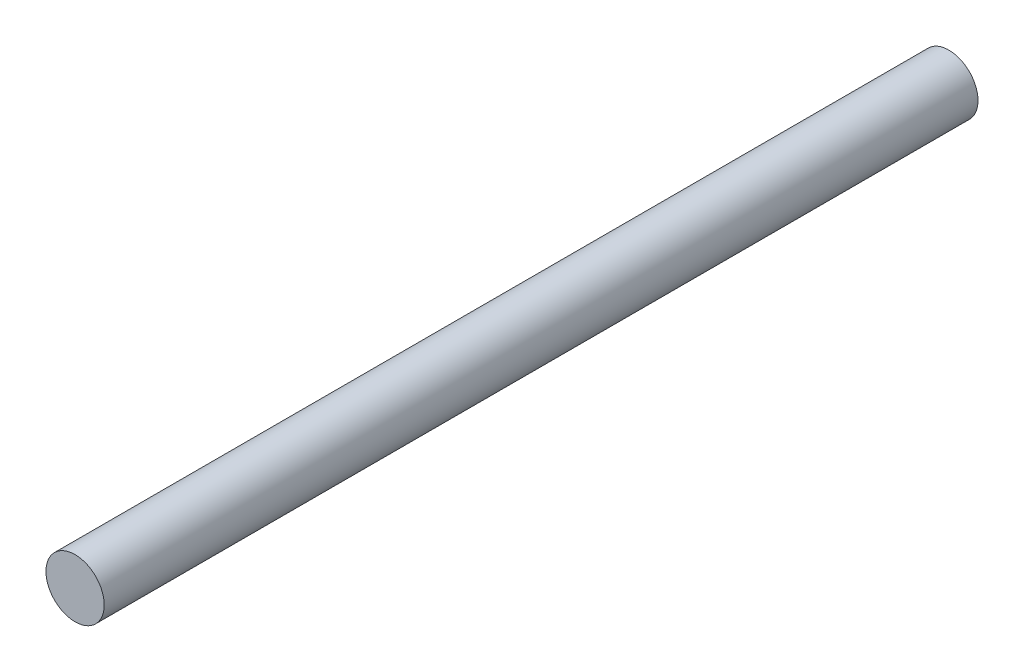
ISO-10303-21;
HEADER;
FILE_DESCRIPTION(('STEP AP214'),'2;1');
FILE_NAME('part.step','',(''),(''),'','','');
FILE_SCHEMA(('AUTOMOTIVE_DESIGN { 1 0 10303 214 1 1 1 1 }'));
ENDSEC;
DATA;
#1=APPLICATION_CONTEXT('core data for automotive mechanical design processes');
#2=APPLICATION_PROTOCOL_DEFINITION('international standard','automotive_design',2000,#1);
#3=PRODUCT_CONTEXT('',#1,'mechanical');
#4=PRODUCT('Part','Part','',(#3));
#5=PRODUCT_RELATED_PRODUCT_CATEGORY('part','',(#4));
#6=PRODUCT_DEFINITION_FORMATION('','',#4);
#7=PRODUCT_DEFINITION_CONTEXT('part definition',#1,'design');
#8=PRODUCT_DEFINITION('design','',#6,#7);
#9=PRODUCT_DEFINITION_SHAPE('','',#8);
#10=(LENGTH_UNIT() NAMED_UNIT(*) SI_UNIT(.MILLI.,.METRE.));
#11=(NAMED_UNIT(*) PLANE_ANGLE_UNIT() SI_UNIT($,.RADIAN.));
#12=(NAMED_UNIT(*) SI_UNIT($,.STERADIAN.) SOLID_ANGLE_UNIT());
#13=UNCERTAINTY_MEASURE_WITH_UNIT(LENGTH_MEASURE(1.E-05),#10,'distance_accuracy_value','');
#14=(GEOMETRIC_REPRESENTATION_CONTEXT(3) GLOBAL_UNCERTAINTY_ASSIGNED_CONTEXT((#13)) GLOBAL_UNIT_ASSIGNED_CONTEXT((#10,
#11,#12)) REPRESENTATION_CONTEXT('',''));
#15=CARTESIAN_POINT('',(0.,0.,0.));
#16=DIRECTION('',(0.,0.,1.));
#17=DIRECTION('',(1.,0.,0.));
#18=AXIS2_PLACEMENT_3D('',#15,#16,#17);
#19=CARTESIAN_POINT('',(0.,0.,90.));
#20=DIRECTION('',(0.,0.,-1.));
#21=DIRECTION('',(-1.,0.,0.));
#22=AXIS2_PLACEMENT_3D('',#19,#20,#21);
#23=CYLINDRICAL_SURFACE('',#22,3.);
#24=CARTESIAN_POINT('',(0.,0.,90.));
#25=DIRECTION('',(0.,0.,1.));
#26=DIRECTION('',(1.,0.,0.));
#27=AXIS2_PLACEMENT_3D('',#24,#25,#26);
#28=CIRCLE('',#27,3.);
#29=CARTESIAN_POINT('',(3.,0.,90.));
#30=VERTEX_POINT('',#29);
#31=EDGE_CURVE('E10',#30,#30,#28,.T.);
#32=ORIENTED_EDGE('',*,*,#31,.F.);
#33=EDGE_LOOP('',(#32));
#34=FACE_BOUND('',#33,.T.);
#35=CARTESIAN_POINT('',(0.,0.,0.));
#36=DIRECTION('',(0.,0.,1.));
#37=DIRECTION('',(1.,0.,0.));
#38=AXIS2_PLACEMENT_3D('',#35,#36,#37);
#39=CIRCLE('',#38,3.);
#40=CARTESIAN_POINT('',(3.,0.,0.));
#41=VERTEX_POINT('',#40);
#42=EDGE_CURVE('E34',#41,#41,#39,.T.);
#43=ORIENTED_EDGE('',*,*,#42,.T.);
#44=EDGE_LOOP('',(#43));
#45=FACE_BOUND('',#44,.T.);
#46=ADVANCED_FACE('F31',(#34,#45),#23,.T.);
#47=CARTESIAN_POINT('',(0.,0.,90.));
#48=DIRECTION('',(0.,0.,1.));
#49=DIRECTION('',(1.,0.,0.));
#50=AXIS2_PLACEMENT_3D('',#47,#48,#49);
#51=PLANE('',#50);
#52=ORIENTED_EDGE('',*,*,#31,.T.);
#53=EDGE_LOOP('',(#52));
#54=FACE_BOUND('',#53,.T.);
#55=ADVANCED_FACE('F46',(#54),#51,.T.);
#56=CARTESIAN_POINT('',(0.,0.,0.));
#57=DIRECTION('',(0.,0.,1.));
#58=DIRECTION('',(1.,0.,0.));
#59=AXIS2_PLACEMENT_3D('',#56,#57,#58);
#60=PLANE('',#59);
#61=ORIENTED_EDGE('',*,*,#42,.F.);
#62=EDGE_LOOP('',(#61));
#63=FACE_BOUND('',#62,.T.);
#64=ADVANCED_FACE('F44',(#63),#60,.F.);
#65=CLOSED_SHELL('',(#46,#55,#64));
#66=MANIFOLD_SOLID_BREP('B2',#65);
#67=ADVANCED_BREP_SHAPE_REPRESENTATION('',(#18,#66),#14);
#68=SHAPE_DEFINITION_REPRESENTATION(#9,#67);
ENDSEC;
END-ISO-10303-21;
